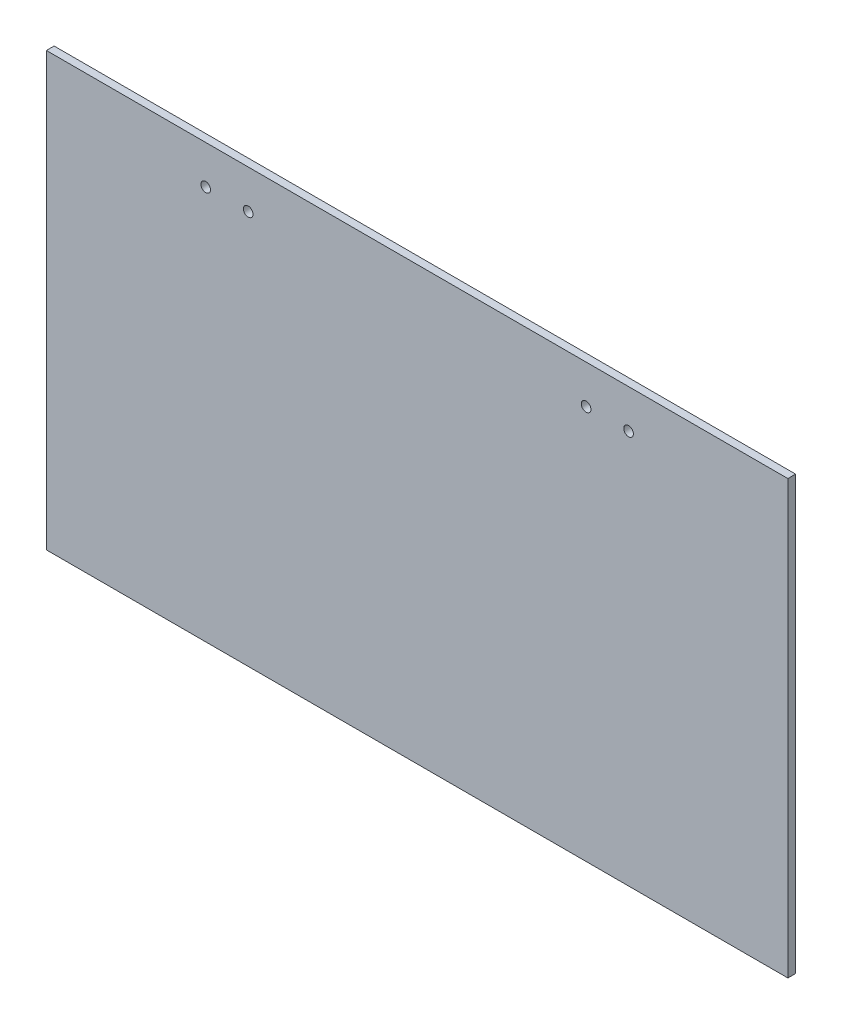
ISO-10303-21;
HEADER;
FILE_DESCRIPTION(('STEP AP214'),'2;1');
FILE_NAME('part.step','',(''),(''),'','','');
FILE_SCHEMA(('AUTOMOTIVE_DESIGN { 1 0 10303 214 1 1 1 1 }'));
ENDSEC;
DATA;
#1=APPLICATION_CONTEXT('core data for automotive mechanical design processes');
#2=APPLICATION_PROTOCOL_DEFINITION('international standard','automotive_design',2000,#1);
#3=PRODUCT_CONTEXT('',#1,'mechanical');
#4=PRODUCT('Part','Part','',(#3));
#5=PRODUCT_RELATED_PRODUCT_CATEGORY('part','',(#4));
#6=PRODUCT_DEFINITION_FORMATION('','',#4);
#7=PRODUCT_DEFINITION_CONTEXT('part definition',#1,'design');
#8=PRODUCT_DEFINITION('design','',#6,#7);
#9=PRODUCT_DEFINITION_SHAPE('','',#8);
#10=(LENGTH_UNIT() NAMED_UNIT(*) SI_UNIT(.MILLI.,.METRE.));
#11=(NAMED_UNIT(*) PLANE_ANGLE_UNIT() SI_UNIT($,.RADIAN.));
#12=(NAMED_UNIT(*) SI_UNIT($,.STERADIAN.) SOLID_ANGLE_UNIT());
#13=UNCERTAINTY_MEASURE_WITH_UNIT(LENGTH_MEASURE(1.E-05),#10,'distance_accuracy_value','');
#14=(GEOMETRIC_REPRESENTATION_CONTEXT(3) GLOBAL_UNCERTAINTY_ASSIGNED_CONTEXT((#13)) GLOBAL_UNIT_ASSIGNED_CONTEXT((#10,
#11,#12)) REPRESENTATION_CONTEXT('',''));
#15=CARTESIAN_POINT('',(0.,0.,0.));
#16=DIRECTION('',(0.,0.,1.));
#17=DIRECTION('',(1.,0.,0.));
#18=AXIS2_PLACEMENT_3D('',#15,#16,#17);
#19=CARTESIAN_POINT('',(152.4,-88.9,3.175));
#20=DIRECTION('',(-1.,0.,0.));
#21=DIRECTION('',(0.,0.,1.));
#22=AXIS2_PLACEMENT_3D('',#19,#20,#21);
#23=PLANE('',#22);
#24=DIRECTION('',(0.,1.,0.));
#25=VECTOR('',#24,1.);
#26=CARTESIAN_POINT('',(152.4,-88.9,0.));
#27=LINE('',#26,#25);
#28=CARTESIAN_POINT('',(152.4,-88.9,0.));
#29=VERTEX_POINT('',#28);
#30=CARTESIAN_POINT('',(152.4,88.9,0.));
#31=VERTEX_POINT('',#30);
#32=EDGE_CURVE('E111',#29,#31,#27,.T.);
#33=ORIENTED_EDGE('',*,*,#32,.T.);
#34=DIRECTION('',(0.,0.,-1.));
#35=VECTOR('',#34,1.);
#36=CARTESIAN_POINT('',(152.4,88.9,3.175));
#37=LINE('',#36,#35);
#38=CARTESIAN_POINT('',(152.4,88.9,3.175));
#39=VERTEX_POINT('',#38);
#40=EDGE_CURVE('E11',#39,#31,#37,.T.);
#41=ORIENTED_EDGE('',*,*,#40,.F.);
#42=DIRECTION('',(0.,1.,0.));
#43=VECTOR('',#42,1.);
#44=CARTESIAN_POINT('',(152.4,-88.9,3.175));
#45=LINE('',#44,#43);
#46=CARTESIAN_POINT('',(152.4,-88.9,3.175));
#47=VERTEX_POINT('',#46);
#48=EDGE_CURVE('E95',#47,#39,#45,.T.);
#49=ORIENTED_EDGE('',*,*,#48,.F.);
#50=DIRECTION('',(0.,0.,-1.));
#51=VECTOR('',#50,1.);
#52=CARTESIAN_POINT('',(152.4,-88.9,3.175));
#53=LINE('',#52,#51);
#54=EDGE_CURVE('E107',#47,#29,#53,.T.);
#55=ORIENTED_EDGE('',*,*,#54,.T.);
#56=EDGE_LOOP('',(#33,#41,#49,#55));
#57=FACE_BOUND('',#56,.T.);
#58=ADVANCED_FACE('F43',(#57),#23,.F.);
#59=CARTESIAN_POINT('',(-152.4,88.9,3.175));
#60=DIRECTION('',(0.,-1.,0.));
#61=DIRECTION('',(0.,0.,-1.));
#62=AXIS2_PLACEMENT_3D('',#59,#60,#61);
#63=PLANE('',#62);
#64=DIRECTION('',(-1.,0.,0.));
#65=VECTOR('',#64,1.);
#66=CARTESIAN_POINT('',(-152.4,88.9,0.));
#67=LINE('',#66,#65);
#68=CARTESIAN_POINT('',(-152.4,88.9,0.));
#69=VERTEX_POINT('',#68);
#70=EDGE_CURVE('E100',#31,#69,#67,.T.);
#71=ORIENTED_EDGE('',*,*,#70,.T.);
#72=DIRECTION('',(0.,0.,-1.));
#73=VECTOR('',#72,1.);
#74=CARTESIAN_POINT('',(-152.4,88.9,3.175));
#75=LINE('',#74,#73);
#76=CARTESIAN_POINT('',(-152.4,88.9,3.175));
#77=VERTEX_POINT('',#76);
#78=EDGE_CURVE('E52',#77,#69,#75,.T.);
#79=ORIENTED_EDGE('',*,*,#78,.F.);
#80=DIRECTION('',(-1.,0.,0.));
#81=VECTOR('',#80,1.);
#82=CARTESIAN_POINT('',(-152.4,88.9,3.175));
#83=LINE('',#82,#81);
#84=EDGE_CURVE('E90',#39,#77,#83,.T.);
#85=ORIENTED_EDGE('',*,*,#84,.F.);
#86=ORIENTED_EDGE('',*,*,#40,.T.);
#87=EDGE_LOOP('',(#71,#79,#85,#86));
#88=FACE_BOUND('',#87,.T.);
#89=ADVANCED_FACE('F99',(#88),#63,.F.);
#90=CARTESIAN_POINT('',(-152.4,-88.9,3.175));
#91=DIRECTION('',(1.,0.,0.));
#92=DIRECTION('',(0.,0.,-1.));
#93=AXIS2_PLACEMENT_3D('',#90,#91,#92);
#94=PLANE('',#93);
#95=DIRECTION('',(0.,-1.,0.));
#96=VECTOR('',#95,1.);
#97=CARTESIAN_POINT('',(-152.4,-88.9,0.));
#98=LINE('',#97,#96);
#99=CARTESIAN_POINT('',(-152.4,-88.9,0.));
#100=VERTEX_POINT('',#99);
#101=EDGE_CURVE('E77',#69,#100,#98,.T.);
#102=ORIENTED_EDGE('',*,*,#101,.T.);
#103=DIRECTION('',(0.,0.,-1.));
#104=VECTOR('',#103,1.);
#105=CARTESIAN_POINT('',(-152.4,-88.9,3.175));
#106=LINE('',#105,#104);
#107=CARTESIAN_POINT('',(-152.4,-88.9,3.175));
#108=VERTEX_POINT('',#107);
#109=EDGE_CURVE('E102',#108,#100,#106,.T.);
#110=ORIENTED_EDGE('',*,*,#109,.F.);
#111=DIRECTION('',(0.,-1.,0.));
#112=VECTOR('',#111,1.);
#113=CARTESIAN_POINT('',(-152.4,-88.9,3.175));
#114=LINE('',#113,#112);
#115=EDGE_CURVE('E93',#77,#108,#114,.T.);
#116=ORIENTED_EDGE('',*,*,#115,.F.);
#117=ORIENTED_EDGE('',*,*,#78,.T.);
#118=EDGE_LOOP('',(#102,#110,#116,#117));
#119=FACE_BOUND('',#118,.T.);
#120=ADVANCED_FACE('F103',(#119),#94,.F.);
#121=CARTESIAN_POINT('',(-152.4,-88.9,3.175));
#122=DIRECTION('',(0.,1.,0.));
#123=DIRECTION('',(0.,0.,1.));
#124=AXIS2_PLACEMENT_3D('',#121,#122,#123);
#125=PLANE('',#124);
#126=DIRECTION('',(1.,0.,0.));
#127=VECTOR('',#126,1.);
#128=CARTESIAN_POINT('',(-152.4,-88.9,0.));
#129=LINE('',#128,#127);
#130=EDGE_CURVE('E83',#100,#29,#129,.T.);
#131=ORIENTED_EDGE('',*,*,#130,.T.);
#132=ORIENTED_EDGE('',*,*,#54,.F.);
#133=DIRECTION('',(1.,0.,0.));
#134=VECTOR('',#133,1.);
#135=CARTESIAN_POINT('',(-152.4,-88.9,3.175));
#136=LINE('',#135,#134);
#137=EDGE_CURVE('E60',#108,#47,#136,.T.);
#138=ORIENTED_EDGE('',*,*,#137,.F.);
#139=ORIENTED_EDGE('',*,*,#109,.T.);
#140=EDGE_LOOP('',(#131,#132,#138,#139));
#141=FACE_BOUND('',#140,.T.);
#142=ADVANCED_FACE('F125',(#141),#125,.F.);
#143=CARTESIAN_POINT('',(0.,0.,3.175));
#144=DIRECTION('',(0.,0.,-1.));
#145=DIRECTION('',(-1.,0.,0.));
#146=AXIS2_PLACEMENT_3D('',#143,#144,#145);
#147=PLANE('',#146);
#148=CARTESIAN_POINT('',(-86.915625,73.025,3.175));
#149=DIRECTION('',(0.,0.,1.));
#150=DIRECTION('',(1.,0.,0.));
#151=AXIS2_PLACEMENT_3D('',#148,#149,#150);
#152=CIRCLE('',#151,1.98437499999999);
#153=CARTESIAN_POINT('',(-84.93125,73.025,3.175));
#154=VERTEX_POINT('',#153);
#155=EDGE_CURVE('E156',#154,#154,#152,.T.);
#156=ORIENTED_EDGE('',*,*,#155,.F.);
#157=EDGE_LOOP('',(#156));
#158=FACE_BOUND('',#157,.T.);
#159=CARTESIAN_POINT('',(-69.453125,73.025,3.175));
#160=DIRECTION('',(0.,0.,1.));
#161=DIRECTION('',(1.,0.,0.));
#162=AXIS2_PLACEMENT_3D('',#159,#160,#161);
#163=CIRCLE('',#162,1.98437499999999);
#164=CARTESIAN_POINT('',(-67.46875,73.025,3.175));
#165=VERTEX_POINT('',#164);
#166=EDGE_CURVE('E152',#165,#165,#163,.T.);
#167=ORIENTED_EDGE('',*,*,#166,.F.);
#168=EDGE_LOOP('',(#167));
#169=FACE_BOUND('',#168,.T.);
#170=CARTESIAN_POINT('',(69.453125,73.025,3.175));
#171=DIRECTION('',(0.,0.,1.));
#172=DIRECTION('',(-1.,0.,0.));
#173=AXIS2_PLACEMENT_3D('',#170,#171,#172);
#174=CIRCLE('',#173,1.98437499999999);
#175=CARTESIAN_POINT('',(67.46875,73.025,3.175));
#176=VERTEX_POINT('',#175);
#177=EDGE_CURVE('E144',#176,#176,#174,.T.);
#178=ORIENTED_EDGE('',*,*,#177,.F.);
#179=EDGE_LOOP('',(#178));
#180=FACE_BOUND('',#179,.T.);
#181=CARTESIAN_POINT('',(86.915625,73.025,3.175));
#182=DIRECTION('',(0.,0.,1.));
#183=DIRECTION('',(-1.,0.,0.));
#184=AXIS2_PLACEMENT_3D('',#181,#182,#183);
#185=CIRCLE('',#184,1.98437499999999);
#186=CARTESIAN_POINT('',(84.93125,73.025,3.175));
#187=VERTEX_POINT('',#186);
#188=EDGE_CURVE('E136',#187,#187,#185,.T.);
#189=ORIENTED_EDGE('',*,*,#188,.F.);
#190=EDGE_LOOP('',(#189));
#191=FACE_BOUND('',#190,.T.);
#192=ORIENTED_EDGE('',*,*,#48,.T.);
#193=ORIENTED_EDGE('',*,*,#84,.T.);
#194=ORIENTED_EDGE('',*,*,#115,.T.);
#195=ORIENTED_EDGE('',*,*,#137,.T.);
#196=EDGE_LOOP('',(#192,#193,#194,#195));
#197=FACE_BOUND('',#196,.T.);
#198=ADVANCED_FACE('F91',(#158,#169,#180,#191,#197),#147,.F.);
#199=CARTESIAN_POINT('',(0.,0.,0.));
#200=DIRECTION('',(0.,0.,-1.));
#201=DIRECTION('',(-1.,0.,0.));
#202=AXIS2_PLACEMENT_3D('',#199,#200,#201);
#203=PLANE('',#202);
#204=CARTESIAN_POINT('',(-86.915625,73.025,0.));
#205=DIRECTION('',(0.,0.,1.));
#206=DIRECTION('',(1.,0.,0.));
#207=AXIS2_PLACEMENT_3D('',#204,#205,#206);
#208=CIRCLE('',#207,1.98437499999999);
#209=CARTESIAN_POINT('',(-84.93125,73.025,0.));
#210=VERTEX_POINT('',#209);
#211=EDGE_CURVE('E115',#210,#210,#208,.T.);
#212=ORIENTED_EDGE('',*,*,#211,.T.);
#213=EDGE_LOOP('',(#212));
#214=FACE_BOUND('',#213,.T.);
#215=CARTESIAN_POINT('',(-69.453125,73.025,0.));
#216=DIRECTION('',(0.,0.,1.));
#217=DIRECTION('',(1.,0.,0.));
#218=AXIS2_PLACEMENT_3D('',#215,#216,#217);
#219=CIRCLE('',#218,1.98437499999999);
#220=CARTESIAN_POINT('',(-67.46875,73.025,0.));
#221=VERTEX_POINT('',#220);
#222=EDGE_CURVE('E148',#221,#221,#219,.T.);
#223=ORIENTED_EDGE('',*,*,#222,.T.);
#224=EDGE_LOOP('',(#223));
#225=FACE_BOUND('',#224,.T.);
#226=CARTESIAN_POINT('',(69.453125,73.025,0.));
#227=DIRECTION('',(0.,0.,1.));
#228=DIRECTION('',(-1.,0.,0.));
#229=AXIS2_PLACEMENT_3D('',#226,#227,#228);
#230=CIRCLE('',#229,1.98437499999999);
#231=CARTESIAN_POINT('',(67.46875,73.025,0.));
#232=VERTEX_POINT('',#231);
#233=EDGE_CURVE('E140',#232,#232,#230,.T.);
#234=ORIENTED_EDGE('',*,*,#233,.T.);
#235=EDGE_LOOP('',(#234));
#236=FACE_BOUND('',#235,.T.);
#237=CARTESIAN_POINT('',(86.915625,73.025,0.));
#238=DIRECTION('',(0.,0.,1.));
#239=DIRECTION('',(-1.,0.,0.));
#240=AXIS2_PLACEMENT_3D('',#237,#238,#239);
#241=CIRCLE('',#240,1.98437499999999);
#242=CARTESIAN_POINT('',(84.93125,73.025,0.));
#243=VERTEX_POINT('',#242);
#244=EDGE_CURVE('E132',#243,#243,#241,.T.);
#245=ORIENTED_EDGE('',*,*,#244,.T.);
#246=EDGE_LOOP('',(#245));
#247=FACE_BOUND('',#246,.T.);
#248=ORIENTED_EDGE('',*,*,#32,.F.);
#249=ORIENTED_EDGE('',*,*,#130,.F.);
#250=ORIENTED_EDGE('',*,*,#101,.F.);
#251=ORIENTED_EDGE('',*,*,#70,.F.);
#252=EDGE_LOOP('',(#248,#249,#250,#251));
#253=FACE_BOUND('',#252,.T.);
#254=ADVANCED_FACE('F128',(#214,#225,#236,#247,#253),#203,.T.);
#255=CARTESIAN_POINT('',(86.915625,73.025,0.));
#256=DIRECTION('',(0.,0.,1.));
#257=DIRECTION('',(1.,0.,0.));
#258=AXIS2_PLACEMENT_3D('',#255,#256,#257);
#259=CYLINDRICAL_SURFACE('',#258,1.98437499999999);
#260=ORIENTED_EDGE('',*,*,#244,.F.);
#261=EDGE_LOOP('',(#260));
#262=FACE_BOUND('',#261,.T.);
#263=ORIENTED_EDGE('',*,*,#188,.T.);
#264=EDGE_LOOP('',(#263));
#265=FACE_BOUND('',#264,.T.);
#266=ADVANCED_FACE('F182',(#262,#265),#259,.F.);
#267=CARTESIAN_POINT('',(69.453125,73.025,0.));
#268=DIRECTION('',(0.,0.,1.));
#269=DIRECTION('',(1.,0.,0.));
#270=AXIS2_PLACEMENT_3D('',#267,#268,#269);
#271=CYLINDRICAL_SURFACE('',#270,1.98437499999999);
#272=ORIENTED_EDGE('',*,*,#233,.F.);
#273=EDGE_LOOP('',(#272));
#274=FACE_BOUND('',#273,.T.);
#275=ORIENTED_EDGE('',*,*,#177,.T.);
#276=EDGE_LOOP('',(#275));
#277=FACE_BOUND('',#276,.T.);
#278=ADVANCED_FACE('F184',(#274,#277),#271,.F.);
#279=CARTESIAN_POINT('',(-69.453125,73.025,0.));
#280=DIRECTION('',(0.,0.,1.));
#281=DIRECTION('',(1.,0.,0.));
#282=AXIS2_PLACEMENT_3D('',#279,#280,#281);
#283=CYLINDRICAL_SURFACE('',#282,1.98437499999999);
#284=ORIENTED_EDGE('',*,*,#222,.F.);
#285=EDGE_LOOP('',(#284));
#286=FACE_BOUND('',#285,.T.);
#287=ORIENTED_EDGE('',*,*,#166,.T.);
#288=EDGE_LOOP('',(#287));
#289=FACE_BOUND('',#288,.T.);
#290=ADVANCED_FACE('F169',(#286,#289),#283,.F.);
#291=CARTESIAN_POINT('',(-86.915625,73.025,0.));
#292=DIRECTION('',(0.,0.,1.));
#293=DIRECTION('',(1.,0.,0.));
#294=AXIS2_PLACEMENT_3D('',#291,#292,#293);
#295=CYLINDRICAL_SURFACE('',#294,1.98437499999999);
#296=ORIENTED_EDGE('',*,*,#211,.F.);
#297=EDGE_LOOP('',(#296));
#298=FACE_BOUND('',#297,.T.);
#299=ORIENTED_EDGE('',*,*,#155,.T.);
#300=EDGE_LOOP('',(#299));
#301=FACE_BOUND('',#300,.T.);
#302=ADVANCED_FACE('F166',(#298,#301),#295,.F.);
#303=CLOSED_SHELL('',(#58,#89,#120,#142,#198,#254,#266,#278,#290,#302));
#304=MANIFOLD_SOLID_BREP('B2',#303);
#305=ADVANCED_BREP_SHAPE_REPRESENTATION('',(#18,#304),#14);
#306=SHAPE_DEFINITION_REPRESENTATION(#9,#305);
ENDSEC;
END-ISO-10303-21;
